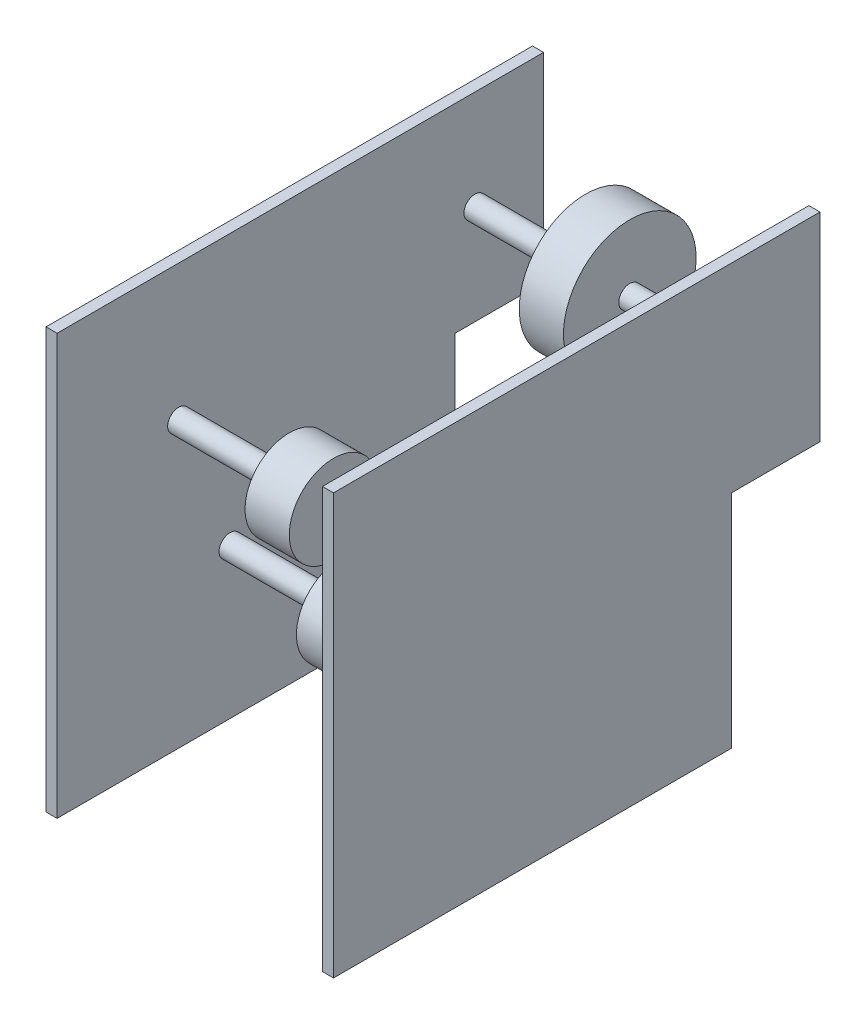
ISO-10303-21;
HEADER;
FILE_DESCRIPTION(('STEP AP214'),'2;1');
FILE_NAME('part.step','',(''),(''),'','','');
FILE_SCHEMA(('AUTOMOTIVE_DESIGN { 1 0 10303 214 1 1 1 1 }'));
ENDSEC;
DATA;
#1=APPLICATION_CONTEXT('core data for automotive mechanical design processes');
#2=APPLICATION_PROTOCOL_DEFINITION('international standard','automotive_design',2000,#1);
#3=PRODUCT_CONTEXT('',#1,'mechanical');
#4=PRODUCT('Part','Part','',(#3));
#5=PRODUCT_RELATED_PRODUCT_CATEGORY('part','',(#4));
#6=PRODUCT_DEFINITION_FORMATION('','',#4);
#7=PRODUCT_DEFINITION_CONTEXT('part definition',#1,'design');
#8=PRODUCT_DEFINITION('design','',#6,#7);
#9=PRODUCT_DEFINITION_SHAPE('','',#8);
#10=(LENGTH_UNIT() NAMED_UNIT(*) SI_UNIT(.MILLI.,.METRE.));
#11=(NAMED_UNIT(*) PLANE_ANGLE_UNIT() SI_UNIT($,.RADIAN.));
#12=(NAMED_UNIT(*) SI_UNIT($,.STERADIAN.) SOLID_ANGLE_UNIT());
#13=UNCERTAINTY_MEASURE_WITH_UNIT(LENGTH_MEASURE(1.E-05),#10,'distance_accuracy_value','');
#14=(GEOMETRIC_REPRESENTATION_CONTEXT(3) GLOBAL_UNCERTAINTY_ASSIGNED_CONTEXT((#13)) GLOBAL_UNIT_ASSIGNED_CONTEXT((#10,
#11,#12)) REPRESENTATION_CONTEXT('',''));
#15=CARTESIAN_POINT('',(0.,0.,0.));
#16=DIRECTION('',(0.,0.,1.));
#17=DIRECTION('',(1.,0.,0.));
#18=AXIS2_PLACEMENT_3D('',#15,#16,#17);
#19=CARTESIAN_POINT('',(76.2,184.15,-240.017328611397));
#20=DIRECTION('',(-1.,0.,0.));
#21=DIRECTION('',(0.,0.,1.));
#22=AXIS2_PLACEMENT_3D('',#19,#20,#21);
#23=CYLINDRICAL_SURFACE('',#22,6.34999999999999);
#24=CARTESIAN_POINT('',(-76.2,184.15,-240.017328611397));
#25=DIRECTION('',(-1.,0.,0.));
#26=DIRECTION('',(0.,0.,1.));
#27=AXIS2_PLACEMENT_3D('',#24,#25,#26);
#28=CIRCLE('',#27,6.34999999999999);
#29=CARTESIAN_POINT('',(-76.2,184.15,-233.667328611397));
#30=VERTEX_POINT('',#29);
#31=EDGE_CURVE('E214',#30,#30,#28,.F.);
#32=ORIENTED_EDGE('',*,*,#31,.T.);
#33=EDGE_LOOP('',(#32));
#34=FACE_BOUND('',#33,.T.);
#35=CARTESIAN_POINT('',(-12.7,184.15,-240.017328611397));
#36=DIRECTION('',(1.,0.,0.));
#37=DIRECTION('',(0.,0.,-1.));
#38=AXIS2_PLACEMENT_3D('',#35,#36,#37);
#39=CIRCLE('',#38,6.34999999999999);
#40=CARTESIAN_POINT('',(-12.7,184.15,-246.367328611397));
#41=VERTEX_POINT('',#40);
#42=EDGE_CURVE('E11',#41,#41,#39,.T.);
#43=ORIENTED_EDGE('',*,*,#42,.F.);
#44=EDGE_LOOP('',(#43));
#45=FACE_BOUND('',#44,.T.);
#46=ADVANCED_FACE('F49',(#34,#45),#23,.T.);
#47=CARTESIAN_POINT('',(76.2,31.75,-161.47216644338));
#48=DIRECTION('',(-1.,0.,0.));
#49=DIRECTION('',(0.,0.,1.));
#50=AXIS2_PLACEMENT_3D('',#47,#48,#49);
#51=CYLINDRICAL_SURFACE('',#50,6.35000000000002);
#52=CARTESIAN_POINT('',(-76.2,31.75,-161.47216644338));
#53=DIRECTION('',(-1.,0.,0.));
#54=DIRECTION('',(0.,0.,1.));
#55=AXIS2_PLACEMENT_3D('',#52,#53,#54);
#56=CIRCLE('',#55,6.35000000000002);
#57=CARTESIAN_POINT('',(-76.2,31.75,-155.12216644338));
#58=VERTEX_POINT('',#57);
#59=EDGE_CURVE('E196',#58,#58,#56,.F.);
#60=ORIENTED_EDGE('',*,*,#59,.T.);
#61=EDGE_LOOP('',(#60));
#62=FACE_BOUND('',#61,.T.);
#63=CARTESIAN_POINT('',(-12.7,31.75,-161.47216644338));
#64=DIRECTION('',(1.,0.,0.));
#65=DIRECTION('',(0.,0.,-1.));
#66=AXIS2_PLACEMENT_3D('',#63,#64,#65);
#67=CIRCLE('',#66,6.35000000000002);
#68=CARTESIAN_POINT('',(-12.7,31.75,-167.82216644338));
#69=VERTEX_POINT('',#68);
#70=EDGE_CURVE('E210',#69,#69,#67,.T.);
#71=ORIENTED_EDGE('',*,*,#70,.F.);
#72=EDGE_LOOP('',(#71));
#73=FACE_BOUND('',#72,.T.);
#74=ADVANCED_FACE('F320',(#62,#73),#51,.T.);
#75=CARTESIAN_POINT('',(76.2,86.1208125309714,-99.3568121038775));
#76=DIRECTION('',(-1.,0.,0.));
#77=DIRECTION('',(0.,0.,1.));
#78=AXIS2_PLACEMENT_3D('',#75,#76,#77);
#79=CYLINDRICAL_SURFACE('',#78,6.34999999999999);
#80=CARTESIAN_POINT('',(-76.2,86.1208125309714,-99.3568121038775));
#81=DIRECTION('',(-1.,0.,0.));
#82=DIRECTION('',(0.,0.,1.));
#83=AXIS2_PLACEMENT_3D('',#80,#81,#82);
#84=CIRCLE('',#83,6.34999999999999);
#85=CARTESIAN_POINT('',(-76.2,86.1208125309714,-93.0068121038775));
#86=VERTEX_POINT('',#85);
#87=EDGE_CURVE('E178',#86,#86,#84,.F.);
#88=ORIENTED_EDGE('',*,*,#87,.T.);
#89=EDGE_LOOP('',(#88));
#90=FACE_BOUND('',#89,.T.);
#91=CARTESIAN_POINT('',(-12.7,86.1208125309714,-99.3568121038775));
#92=DIRECTION('',(1.,0.,0.));
#93=DIRECTION('',(0.,0.,-1.));
#94=AXIS2_PLACEMENT_3D('',#91,#92,#93);
#95=CIRCLE('',#94,6.34999999999999);
#96=CARTESIAN_POINT('',(-12.7,86.1208125309714,-105.706812103877));
#97=VERTEX_POINT('',#96);
#98=EDGE_CURVE('E192',#97,#97,#95,.T.);
#99=ORIENTED_EDGE('',*,*,#98,.F.);
#100=EDGE_LOOP('',(#99));
#101=FACE_BOUND('',#100,.T.);
#102=ADVANCED_FACE('F327',(#90,#101),#79,.T.);
#103=CARTESIAN_POINT('',(76.2,163.217184296875,-69.85));
#104=DIRECTION('',(-1.,0.,0.));
#105=DIRECTION('',(0.,0.,1.));
#106=AXIS2_PLACEMENT_3D('',#103,#104,#105);
#107=CYLINDRICAL_SURFACE('',#106,6.34999999999999);
#108=CARTESIAN_POINT('',(12.7,163.217184296875,-69.85));
#109=DIRECTION('',(1.,0.,0.));
#110=DIRECTION('',(0.,0.,-1.));
#111=AXIS2_PLACEMENT_3D('',#108,#109,#110);
#112=CIRCLE('',#111,6.34999999999999);
#113=CARTESIAN_POINT('',(12.7,163.217184296875,-76.2));
#114=VERTEX_POINT('',#113);
#115=EDGE_CURVE('E179',#114,#114,#112,.T.);
#116=ORIENTED_EDGE('',*,*,#115,.T.);
#117=EDGE_LOOP('',(#116));
#118=FACE_BOUND('',#117,.T.);
#119=CARTESIAN_POINT('',(76.2,163.217184296875,-69.85));
#120=DIRECTION('',(1.,0.,0.));
#121=DIRECTION('',(0.,0.,-1.));
#122=AXIS2_PLACEMENT_3D('',#119,#120,#121);
#123=CIRCLE('',#122,6.34999999999999);
#124=CARTESIAN_POINT('',(76.2,163.217184296875,-76.2));
#125=VERTEX_POINT('',#124);
#126=EDGE_CURVE('E152',#125,#125,#123,.T.);
#127=ORIENTED_EDGE('',*,*,#126,.F.);
#128=EDGE_LOOP('',(#127));
#129=FACE_BOUND('',#128,.T.);
#130=ADVANCED_FACE('F477',(#118,#129),#107,.T.);
#131=CARTESIAN_POINT('',(82.55,0.,0.));
#132=DIRECTION('',(-1.,0.,0.));
#133=DIRECTION('',(0.,0.,1.));
#134=AXIS2_PLACEMENT_3D('',#131,#132,#133);
#135=PLANE('',#134);
#136=DIRECTION('',(0.,-1.,0.));
#137=VECTOR('',#136,1.);
#138=CARTESIAN_POINT('',(82.55,0.,0.));
#139=LINE('',#138,#137);
#140=CARTESIAN_POINT('',(82.55,241.3,0.));
#141=VERTEX_POINT('',#140);
#142=CARTESIAN_POINT('',(82.55,0.,0.));
#143=VERTEX_POINT('',#142);
#144=EDGE_CURVE('E395',#141,#143,#139,.T.);
#145=ORIENTED_EDGE('',*,*,#144,.T.);
#146=DIRECTION('',(0.,0.,-1.));
#147=VECTOR('',#146,1.);
#148=CARTESIAN_POINT('',(82.55,0.,0.));
#149=LINE('',#148,#147);
#150=CARTESIAN_POINT('',(82.55,0.,-228.6));
#151=VERTEX_POINT('',#150);
#152=EDGE_CURVE('E279',#143,#151,#149,.T.);
#153=ORIENTED_EDGE('',*,*,#152,.T.);
#154=DIRECTION('',(0.,1.,0.));
#155=VECTOR('',#154,1.);
#156=CARTESIAN_POINT('',(82.55,127.,-228.6));
#157=LINE('',#156,#155);
#158=CARTESIAN_POINT('',(82.55,127.,-228.6));
#159=VERTEX_POINT('',#158);
#160=EDGE_CURVE('E400',#151,#159,#157,.T.);
#161=ORIENTED_EDGE('',*,*,#160,.T.);
#162=DIRECTION('',(0.,0.,-1.));
#163=VECTOR('',#162,1.);
#164=CARTESIAN_POINT('',(82.55,127.,-228.6));
#165=LINE('',#164,#163);
#166=CARTESIAN_POINT('',(82.55,127.,-279.4));
#167=VERTEX_POINT('',#166);
#168=EDGE_CURVE('E404',#159,#167,#165,.T.);
#169=ORIENTED_EDGE('',*,*,#168,.T.);
#170=DIRECTION('',(0.,1.,0.));
#171=VECTOR('',#170,1.);
#172=CARTESIAN_POINT('',(82.55,241.3,-279.4));
#173=LINE('',#172,#171);
#174=CARTESIAN_POINT('',(82.55,241.3,-279.4));
#175=VERTEX_POINT('',#174);
#176=EDGE_CURVE('E408',#167,#175,#173,.T.);
#177=ORIENTED_EDGE('',*,*,#176,.T.);
#178=DIRECTION('',(0.,0.,1.));
#179=VECTOR('',#178,1.);
#180=CARTESIAN_POINT('',(82.55,241.3,0.));
#181=LINE('',#180,#179);
#182=EDGE_CURVE('E412',#175,#141,#181,.T.);
#183=ORIENTED_EDGE('',*,*,#182,.T.);
#184=EDGE_LOOP('',(#145,#153,#161,#169,#177,#183));
#185=FACE_BOUND('',#184,.T.);
#186=ADVANCED_FACE('F450',(#185),#135,.F.);
#187=CARTESIAN_POINT('',(82.55,241.3,0.));
#188=DIRECTION('',(0.,-1.,0.));
#189=DIRECTION('',(0.,0.,-1.));
#190=AXIS2_PLACEMENT_3D('',#187,#188,#189);
#191=PLANE('',#190);
#192=DIRECTION('',(-1.,0.,0.));
#193=VECTOR('',#192,1.);
#194=CARTESIAN_POINT('',(82.55,241.3,-279.4));
#195=LINE('',#194,#193);
#196=CARTESIAN_POINT('',(76.2,241.3,-279.4));
#197=VERTEX_POINT('',#196);
#198=EDGE_CURVE('E418',#175,#197,#195,.T.);
#199=ORIENTED_EDGE('',*,*,#198,.T.);
#200=DIRECTION('',(0.,0.,-1.));
#201=VECTOR('',#200,1.);
#202=CARTESIAN_POINT('',(76.2,241.3,0.));
#203=LINE('',#202,#201);
#204=CARTESIAN_POINT('',(76.2,241.3,0.));
#205=VERTEX_POINT('',#204);
#206=EDGE_CURVE('E183',#205,#197,#203,.T.);
#207=ORIENTED_EDGE('',*,*,#206,.F.);
#208=DIRECTION('',(-1.,0.,0.));
#209=VECTOR('',#208,1.);
#210=CARTESIAN_POINT('',(82.55,241.3,0.));
#211=LINE('',#210,#209);
#212=EDGE_CURVE('E272',#141,#205,#211,.T.);
#213=ORIENTED_EDGE('',*,*,#212,.F.);
#214=ORIENTED_EDGE('',*,*,#182,.F.);
#215=EDGE_LOOP('',(#199,#207,#213,#214));
#216=FACE_BOUND('',#215,.T.);
#217=ADVANCED_FACE('F454',(#216),#191,.F.);
#218=CARTESIAN_POINT('',(82.55,241.3,-279.4));
#219=DIRECTION('',(0.,0.,1.));
#220=DIRECTION('',(1.,0.,0.));
#221=AXIS2_PLACEMENT_3D('',#218,#219,#220);
#222=PLANE('',#221);
#223=DIRECTION('',(-1.,0.,0.));
#224=VECTOR('',#223,1.);
#225=CARTESIAN_POINT('',(82.55,127.,-279.4));
#226=LINE('',#225,#224);
#227=CARTESIAN_POINT('',(76.2,127.,-279.4));
#228=VERTEX_POINT('',#227);
#229=EDGE_CURVE('E422',#167,#228,#226,.T.);
#230=ORIENTED_EDGE('',*,*,#229,.T.);
#231=DIRECTION('',(0.,1.,0.));
#232=VECTOR('',#231,1.);
#233=CARTESIAN_POINT('',(76.2,0.,-279.4));
#234=LINE('',#233,#232);
#235=EDGE_CURVE('E274',#228,#197,#234,.T.);
#236=ORIENTED_EDGE('',*,*,#235,.T.);
#237=ORIENTED_EDGE('',*,*,#198,.F.);
#238=ORIENTED_EDGE('',*,*,#176,.F.);
#239=EDGE_LOOP('',(#230,#236,#237,#238));
#240=FACE_BOUND('',#239,.T.);
#241=ADVANCED_FACE('F458',(#240),#222,.F.);
#242=CARTESIAN_POINT('',(82.55,127.,-228.6));
#243=DIRECTION('',(0.,1.,0.));
#244=DIRECTION('',(0.,0.,1.));
#245=AXIS2_PLACEMENT_3D('',#242,#243,#244);
#246=PLANE('',#245);
#247=DIRECTION('',(-1.,0.,0.));
#248=VECTOR('',#247,1.);
#249=CARTESIAN_POINT('',(82.55,127.,-228.6));
#250=LINE('',#249,#248);
#251=CARTESIAN_POINT('',(76.2,127.,-228.6));
#252=VERTEX_POINT('',#251);
#253=EDGE_CURVE('E287',#159,#252,#250,.T.);
#254=ORIENTED_EDGE('',*,*,#253,.T.);
#255=DIRECTION('',(0.,0.,-1.));
#256=VECTOR('',#255,1.);
#257=CARTESIAN_POINT('',(76.2,127.,-228.6));
#258=LINE('',#257,#256);
#259=EDGE_CURVE('E388',#252,#228,#258,.T.);
#260=ORIENTED_EDGE('',*,*,#259,.T.);
#261=ORIENTED_EDGE('',*,*,#229,.F.);
#262=ORIENTED_EDGE('',*,*,#168,.F.);
#263=EDGE_LOOP('',(#254,#260,#261,#262));
#264=FACE_BOUND('',#263,.T.);
#265=ADVANCED_FACE('F431',(#264),#246,.F.);
#266=CARTESIAN_POINT('',(82.55,127.,-228.6));
#267=DIRECTION('',(0.,0.,1.));
#268=DIRECTION('',(1.,0.,0.));
#269=AXIS2_PLACEMENT_3D('',#266,#267,#268);
#270=PLANE('',#269);
#271=DIRECTION('',(-1.,0.,0.));
#272=VECTOR('',#271,1.);
#273=CARTESIAN_POINT('',(82.55,0.,-228.6));
#274=LINE('',#273,#272);
#275=CARTESIAN_POINT('',(76.2,0.,-228.6));
#276=VERTEX_POINT('',#275);
#277=EDGE_CURVE('E282',#151,#276,#274,.T.);
#278=ORIENTED_EDGE('',*,*,#277,.T.);
#279=DIRECTION('',(0.,1.,0.));
#280=VECTOR('',#279,1.);
#281=CARTESIAN_POINT('',(76.2,127.,-228.6));
#282=LINE('',#281,#280);
#283=EDGE_CURVE('E256',#276,#252,#282,.T.);
#284=ORIENTED_EDGE('',*,*,#283,.T.);
#285=ORIENTED_EDGE('',*,*,#253,.F.);
#286=ORIENTED_EDGE('',*,*,#160,.F.);
#287=EDGE_LOOP('',(#278,#284,#285,#286));
#288=FACE_BOUND('',#287,.T.);
#289=ADVANCED_FACE('F438',(#288),#270,.F.);
#290=CARTESIAN_POINT('',(82.55,0.,0.));
#291=DIRECTION('',(0.,1.,0.));
#292=DIRECTION('',(0.,0.,1.));
#293=AXIS2_PLACEMENT_3D('',#290,#291,#292);
#294=PLANE('',#293);
#295=DIRECTION('',(-1.,0.,0.));
#296=VECTOR('',#295,1.);
#297=CARTESIAN_POINT('',(82.55,0.,0.));
#298=LINE('',#297,#296);
#299=CARTESIAN_POINT('',(76.2,0.,0.));
#300=VERTEX_POINT('',#299);
#301=EDGE_CURVE('E270',#143,#300,#298,.T.);
#302=ORIENTED_EDGE('',*,*,#301,.T.);
#303=DIRECTION('',(0.,0.,-1.));
#304=VECTOR('',#303,1.);
#305=CARTESIAN_POINT('',(76.2,0.,0.));
#306=LINE('',#305,#304);
#307=EDGE_CURVE('E248',#300,#276,#306,.T.);
#308=ORIENTED_EDGE('',*,*,#307,.T.);
#309=ORIENTED_EDGE('',*,*,#277,.F.);
#310=ORIENTED_EDGE('',*,*,#152,.F.);
#311=EDGE_LOOP('',(#302,#308,#309,#310));
#312=FACE_BOUND('',#311,.T.);
#313=ADVANCED_FACE('F277',(#312),#294,.F.);
#314=CARTESIAN_POINT('',(82.55,0.,0.));
#315=DIRECTION('',(0.,0.,-1.));
#316=DIRECTION('',(-1.,0.,0.));
#317=AXIS2_PLACEMENT_3D('',#314,#315,#316);
#318=PLANE('',#317);
#319=ORIENTED_EDGE('',*,*,#212,.T.);
#320=DIRECTION('',(0.,1.,0.));
#321=VECTOR('',#320,1.);
#322=CARTESIAN_POINT('',(76.2,0.,0.));
#323=LINE('',#322,#321);
#324=EDGE_CURVE('E251',#300,#205,#323,.T.);
#325=ORIENTED_EDGE('',*,*,#324,.F.);
#326=ORIENTED_EDGE('',*,*,#301,.F.);
#327=ORIENTED_EDGE('',*,*,#144,.F.);
#328=EDGE_LOOP('',(#319,#325,#326,#327));
#329=FACE_BOUND('',#328,.T.);
#330=ADVANCED_FACE('F234',(#329),#318,.F.);
#331=CARTESIAN_POINT('',(76.2,0.,0.));
#332=DIRECTION('',(1.,0.,0.));
#333=DIRECTION('',(0.,0.,-1.));
#334=AXIS2_PLACEMENT_3D('',#331,#332,#333);
#335=PLANE('',#334);
#336=CARTESIAN_POINT('',(76.2,184.15,-240.017328611397));
#337=DIRECTION('',(1.,0.,0.));
#338=DIRECTION('',(0.,0.,-1.));
#339=AXIS2_PLACEMENT_3D('',#336,#337,#338);
#340=CIRCLE('',#339,6.34999999999999);
#341=CARTESIAN_POINT('',(76.2,184.15,-246.367328611397));
#342=VERTEX_POINT('',#341);
#343=EDGE_CURVE('E60',#342,#342,#340,.F.);
#344=ORIENTED_EDGE('',*,*,#343,.F.);
#345=EDGE_LOOP('',(#344));
#346=FACE_BOUND('',#345,.T.);
#347=CARTESIAN_POINT('',(76.2,31.75,-161.47216644338));
#348=DIRECTION('',(1.,0.,0.));
#349=DIRECTION('',(0.,0.,-1.));
#350=AXIS2_PLACEMENT_3D('',#347,#348,#349);
#351=CIRCLE('',#350,6.35000000000002);
#352=CARTESIAN_POINT('',(76.2,31.75,-167.82216644338));
#353=VERTEX_POINT('',#352);
#354=EDGE_CURVE('E206',#353,#353,#351,.F.);
#355=ORIENTED_EDGE('',*,*,#354,.F.);
#356=EDGE_LOOP('',(#355));
#357=FACE_BOUND('',#356,.T.);
#358=CARTESIAN_POINT('',(76.2,86.1208125309714,-99.3568121038775));
#359=DIRECTION('',(1.,0.,0.));
#360=DIRECTION('',(0.,0.,-1.));
#361=AXIS2_PLACEMENT_3D('',#358,#359,#360);
#362=CIRCLE('',#361,6.34999999999999);
#363=CARTESIAN_POINT('',(76.2,86.1208125309714,-105.706812103877));
#364=VERTEX_POINT('',#363);
#365=EDGE_CURVE('E188',#364,#364,#362,.F.);
#366=ORIENTED_EDGE('',*,*,#365,.F.);
#367=EDGE_LOOP('',(#366));
#368=FACE_BOUND('',#367,.T.);
#369=ORIENTED_EDGE('',*,*,#126,.T.);
#370=EDGE_LOOP('',(#369));
#371=FACE_BOUND('',#370,.T.);
#372=ORIENTED_EDGE('',*,*,#307,.F.);
#373=ORIENTED_EDGE('',*,*,#324,.T.);
#374=ORIENTED_EDGE('',*,*,#206,.T.);
#375=ORIENTED_EDGE('',*,*,#235,.F.);
#376=ORIENTED_EDGE('',*,*,#259,.F.);
#377=ORIENTED_EDGE('',*,*,#283,.F.);
#378=EDGE_LOOP('',(#372,#373,#374,#375,#376,#377));
#379=FACE_BOUND('',#378,.T.);
#380=ADVANCED_FACE('F230',(#346,#357,#368,#371,#379),#335,.F.);
#381=CARTESIAN_POINT('',(12.7,163.217184296875,-69.85));
#382=DIRECTION('',(-1.,0.,0.));
#383=DIRECTION('',(0.,0.,1.));
#384=AXIS2_PLACEMENT_3D('',#381,#382,#383);
#385=CYLINDRICAL_SURFACE('',#384,25.4);
#386=CARTESIAN_POINT('',(12.7,163.217184296875,-69.85));
#387=DIRECTION('',(1.,0.,0.));
#388=DIRECTION('',(0.,0.,-1.));
#389=AXIS2_PLACEMENT_3D('',#386,#387,#388);
#390=CIRCLE('',#389,25.4);
#391=CARTESIAN_POINT('',(12.7,163.217184296875,-95.25));
#392=VERTEX_POINT('',#391);
#393=EDGE_CURVE('E201',#392,#392,#390,.T.);
#394=ORIENTED_EDGE('',*,*,#393,.F.);
#395=EDGE_LOOP('',(#394));
#396=FACE_BOUND('',#395,.T.);
#397=CARTESIAN_POINT('',(-12.7,163.217184296875,-69.85));
#398=DIRECTION('',(1.,0.,0.));
#399=DIRECTION('',(0.,0.,-1.));
#400=AXIS2_PLACEMENT_3D('',#397,#398,#399);
#401=CIRCLE('',#400,25.4);
#402=CARTESIAN_POINT('',(-12.7,163.217184296875,-95.25));
#403=VERTEX_POINT('',#402);
#404=EDGE_CURVE('E184',#403,#403,#401,.T.);
#405=ORIENTED_EDGE('',*,*,#404,.T.);
#406=EDGE_LOOP('',(#405));
#407=FACE_BOUND('',#406,.T.);
#408=ADVANCED_FACE('F233',(#396,#407),#385,.T.);
#409=CARTESIAN_POINT('',(12.7,163.217184296875,-69.85));
#410=DIRECTION('',(1.,0.,0.));
#411=DIRECTION('',(0.,0.,-1.));
#412=AXIS2_PLACEMENT_3D('',#409,#410,#411);
#413=PLANE('',#412);
#414=ORIENTED_EDGE('',*,*,#115,.F.);
#415=EDGE_LOOP('',(#414));
#416=FACE_BOUND('',#415,.T.);
#417=ORIENTED_EDGE('',*,*,#393,.T.);
#418=EDGE_LOOP('',(#417));
#419=FACE_BOUND('',#418,.T.);
#420=ADVANCED_FACE('F506',(#416,#419),#413,.T.);
#421=CARTESIAN_POINT('',(-12.7,163.217184296875,-69.85));
#422=DIRECTION('',(1.,0.,0.));
#423=DIRECTION('',(0.,0.,-1.));
#424=AXIS2_PLACEMENT_3D('',#421,#422,#423);
#425=PLANE('',#424);
#426=CARTESIAN_POINT('',(-12.7,163.217184296875,-69.85));
#427=DIRECTION('',(1.,0.,0.));
#428=DIRECTION('',(0.,0.,-1.));
#429=AXIS2_PLACEMENT_3D('',#426,#427,#428);
#430=CIRCLE('',#429,6.34999999999999);
#431=CARTESIAN_POINT('',(-12.7,163.217184296875,-76.2));
#432=VERTEX_POINT('',#431);
#433=EDGE_CURVE('E174',#432,#432,#430,.T.);
#434=ORIENTED_EDGE('',*,*,#433,.T.);
#435=EDGE_LOOP('',(#434));
#436=FACE_BOUND('',#435,.T.);
#437=ORIENTED_EDGE('',*,*,#404,.F.);
#438=EDGE_LOOP('',(#437));
#439=FACE_BOUND('',#438,.T.);
#440=ADVANCED_FACE('F483',(#436,#439),#425,.F.);
#441=CARTESIAN_POINT('',(-82.55,0.,0.));
#442=DIRECTION('',(-1.,0.,0.));
#443=DIRECTION('',(0.,0.,1.));
#444=AXIS2_PLACEMENT_3D('',#441,#442,#443);
#445=PLANE('',#444);
#446=DIRECTION('',(0.,-1.,0.));
#447=VECTOR('',#446,1.);
#448=CARTESIAN_POINT('',(-82.55,0.,0.));
#449=LINE('',#448,#447);
#450=CARTESIAN_POINT('',(-82.55,241.3,0.));
#451=VERTEX_POINT('',#450);
#452=CARTESIAN_POINT('',(-82.55,0.,0.));
#453=VERTEX_POINT('',#452);
#454=EDGE_CURVE('E127',#451,#453,#449,.T.);
#455=ORIENTED_EDGE('',*,*,#454,.F.);
#456=DIRECTION('',(0.,0.,1.));
#457=VECTOR('',#456,1.);
#458=CARTESIAN_POINT('',(-82.55,241.3,0.));
#459=LINE('',#458,#457);
#460=CARTESIAN_POINT('',(-82.55,241.3,-279.4));
#461=VERTEX_POINT('',#460);
#462=EDGE_CURVE('E155',#461,#451,#459,.T.);
#463=ORIENTED_EDGE('',*,*,#462,.F.);
#464=DIRECTION('',(0.,1.,0.));
#465=VECTOR('',#464,1.);
#466=CARTESIAN_POINT('',(-82.55,241.3,-279.4));
#467=LINE('',#466,#465);
#468=CARTESIAN_POINT('',(-82.55,127.,-279.4));
#469=VERTEX_POINT('',#468);
#470=EDGE_CURVE('E167',#469,#461,#467,.T.);
#471=ORIENTED_EDGE('',*,*,#470,.F.);
#472=DIRECTION('',(0.,0.,-1.));
#473=VECTOR('',#472,1.);
#474=CARTESIAN_POINT('',(-82.55,127.,-228.6));
#475=LINE('',#474,#473);
#476=CARTESIAN_POINT('',(-82.55,127.,-228.6));
#477=VERTEX_POINT('',#476);
#478=EDGE_CURVE('E163',#477,#469,#475,.T.);
#479=ORIENTED_EDGE('',*,*,#478,.F.);
#480=DIRECTION('',(0.,1.,0.));
#481=VECTOR('',#480,1.);
#482=CARTESIAN_POINT('',(-82.55,127.,-228.6));
#483=LINE('',#482,#481);
#484=CARTESIAN_POINT('',(-82.55,0.,-228.6));
#485=VERTEX_POINT('',#484);
#486=EDGE_CURVE('E129',#485,#477,#483,.T.);
#487=ORIENTED_EDGE('',*,*,#486,.F.);
#488=DIRECTION('',(0.,0.,-1.));
#489=VECTOR('',#488,1.);
#490=CARTESIAN_POINT('',(-82.55,0.,0.));
#491=LINE('',#490,#489);
#492=EDGE_CURVE('E116',#453,#485,#491,.T.);
#493=ORIENTED_EDGE('',*,*,#492,.F.);
#494=EDGE_LOOP('',(#455,#463,#471,#479,#487,#493));
#495=FACE_BOUND('',#494,.T.);
#496=ADVANCED_FACE('F125',(#495),#445,.T.);
#497=CARTESIAN_POINT('',(82.55,127.,-228.6));
#498=DIRECTION('',(0.,0.,1.));
#499=DIRECTION('',(1.,0.,0.));
#500=AXIS2_PLACEMENT_3D('',#497,#498,#499);
#501=PLANE('',#500);
#502=DIRECTION('',(-1.,0.,0.));
#503=VECTOR('',#502,1.);
#504=CARTESIAN_POINT('',(82.55,127.,-228.6));
#505=LINE('',#504,#503);
#506=CARTESIAN_POINT('',(-76.2,127.,-228.6));
#507=VERTEX_POINT('',#506);
#508=EDGE_CURVE('E149',#507,#477,#505,.T.);
#509=ORIENTED_EDGE('',*,*,#508,.F.);
#510=DIRECTION('',(0.,-1.,0.));
#511=VECTOR('',#510,1.);
#512=CARTESIAN_POINT('',(-76.2,127.,-228.6));
#513=LINE('',#512,#511);
#514=CARTESIAN_POINT('',(-76.2,0.,-228.6));
#515=VERTEX_POINT('',#514);
#516=EDGE_CURVE('E68',#507,#515,#513,.T.);
#517=ORIENTED_EDGE('',*,*,#516,.T.);
#518=DIRECTION('',(-1.,0.,0.));
#519=VECTOR('',#518,1.);
#520=CARTESIAN_POINT('',(82.55,0.,-228.6));
#521=LINE('',#520,#519);
#522=EDGE_CURVE('E107',#515,#485,#521,.T.);
#523=ORIENTED_EDGE('',*,*,#522,.T.);
#524=ORIENTED_EDGE('',*,*,#486,.T.);
#525=EDGE_LOOP('',(#509,#517,#523,#524));
#526=FACE_BOUND('',#525,.T.);
#527=ADVANCED_FACE('F300',(#526),#501,.F.);
#528=CARTESIAN_POINT('',(82.55,0.,0.));
#529=DIRECTION('',(0.,1.,0.));
#530=DIRECTION('',(0.,0.,1.));
#531=AXIS2_PLACEMENT_3D('',#528,#529,#530);
#532=PLANE('',#531);
#533=ORIENTED_EDGE('',*,*,#522,.F.);
#534=DIRECTION('',(0.,0.,1.));
#535=VECTOR('',#534,1.);
#536=CARTESIAN_POINT('',(-76.2,0.,0.));
#537=LINE('',#536,#535);
#538=CARTESIAN_POINT('',(-76.2,0.,0.));
#539=VERTEX_POINT('',#538);
#540=EDGE_CURVE('E118',#515,#539,#537,.T.);
#541=ORIENTED_EDGE('',*,*,#540,.T.);
#542=DIRECTION('',(-1.,0.,0.));
#543=VECTOR('',#542,1.);
#544=CARTESIAN_POINT('',(82.55,0.,0.));
#545=LINE('',#544,#543);
#546=EDGE_CURVE('E113',#539,#453,#545,.T.);
#547=ORIENTED_EDGE('',*,*,#546,.T.);
#548=ORIENTED_EDGE('',*,*,#492,.T.);
#549=EDGE_LOOP('',(#533,#541,#547,#548));
#550=FACE_BOUND('',#549,.T.);
#551=ADVANCED_FACE('F115',(#550),#532,.F.);
#552=CARTESIAN_POINT('',(82.55,0.,0.));
#553=DIRECTION('',(0.,0.,-1.));
#554=DIRECTION('',(-1.,0.,0.));
#555=AXIS2_PLACEMENT_3D('',#552,#553,#554);
#556=PLANE('',#555);
#557=ORIENTED_EDGE('',*,*,#546,.F.);
#558=DIRECTION('',(0.,1.,0.));
#559=VECTOR('',#558,1.);
#560=CARTESIAN_POINT('',(-76.2,0.,0.));
#561=LINE('',#560,#559);
#562=CARTESIAN_POINT('',(-76.2,241.3,0.));
#563=VERTEX_POINT('',#562);
#564=EDGE_CURVE('E140',#539,#563,#561,.T.);
#565=ORIENTED_EDGE('',*,*,#564,.T.);
#566=DIRECTION('',(-1.,0.,0.));
#567=VECTOR('',#566,1.);
#568=CARTESIAN_POINT('',(82.55,241.3,0.));
#569=LINE('',#568,#567);
#570=EDGE_CURVE('E133',#563,#451,#569,.T.);
#571=ORIENTED_EDGE('',*,*,#570,.T.);
#572=ORIENTED_EDGE('',*,*,#454,.T.);
#573=EDGE_LOOP('',(#557,#565,#571,#572));
#574=FACE_BOUND('',#573,.T.);
#575=ADVANCED_FACE('F51',(#574),#556,.F.);
#576=CARTESIAN_POINT('',(82.55,241.3,0.));
#577=DIRECTION('',(0.,-1.,0.));
#578=DIRECTION('',(0.,0.,-1.));
#579=AXIS2_PLACEMENT_3D('',#576,#577,#578);
#580=PLANE('',#579);
#581=ORIENTED_EDGE('',*,*,#570,.F.);
#582=DIRECTION('',(0.,0.,1.));
#583=VECTOR('',#582,1.);
#584=CARTESIAN_POINT('',(-76.2,241.3,0.));
#585=LINE('',#584,#583);
#586=CARTESIAN_POINT('',(-76.2,241.3,-279.4));
#587=VERTEX_POINT('',#586);
#588=EDGE_CURVE('E83',#587,#563,#585,.T.);
#589=ORIENTED_EDGE('',*,*,#588,.F.);
#590=DIRECTION('',(-1.,0.,0.));
#591=VECTOR('',#590,1.);
#592=CARTESIAN_POINT('',(82.55,241.3,-279.4));
#593=LINE('',#592,#591);
#594=EDGE_CURVE('E168',#587,#461,#593,.T.);
#595=ORIENTED_EDGE('',*,*,#594,.T.);
#596=ORIENTED_EDGE('',*,*,#462,.T.);
#597=EDGE_LOOP('',(#581,#589,#595,#596));
#598=FACE_BOUND('',#597,.T.);
#599=ADVANCED_FACE('F310',(#598),#580,.F.);
#600=CARTESIAN_POINT('',(82.55,241.3,-279.4));
#601=DIRECTION('',(0.,0.,1.));
#602=DIRECTION('',(1.,0.,0.));
#603=AXIS2_PLACEMENT_3D('',#600,#601,#602);
#604=PLANE('',#603);
#605=ORIENTED_EDGE('',*,*,#594,.F.);
#606=DIRECTION('',(0.,1.,0.));
#607=VECTOR('',#606,1.);
#608=CARTESIAN_POINT('',(-76.2,0.,-279.4));
#609=LINE('',#608,#607);
#610=CARTESIAN_POINT('',(-76.2,127.,-279.4));
#611=VERTEX_POINT('',#610);
#612=EDGE_CURVE('E87',#611,#587,#609,.T.);
#613=ORIENTED_EDGE('',*,*,#612,.F.);
#614=DIRECTION('',(-1.,0.,0.));
#615=VECTOR('',#614,1.);
#616=CARTESIAN_POINT('',(82.55,127.,-279.4));
#617=LINE('',#616,#615);
#618=EDGE_CURVE('E164',#611,#469,#617,.T.);
#619=ORIENTED_EDGE('',*,*,#618,.T.);
#620=ORIENTED_EDGE('',*,*,#470,.T.);
#621=EDGE_LOOP('',(#605,#613,#619,#620));
#622=FACE_BOUND('',#621,.T.);
#623=ADVANCED_FACE('F308',(#622),#604,.F.);
#624=CARTESIAN_POINT('',(82.55,127.,-228.6));
#625=DIRECTION('',(0.,1.,0.));
#626=DIRECTION('',(0.,0.,1.));
#627=AXIS2_PLACEMENT_3D('',#624,#625,#626);
#628=PLANE('',#627);
#629=ORIENTED_EDGE('',*,*,#618,.F.);
#630=DIRECTION('',(0.,0.,1.));
#631=VECTOR('',#630,1.);
#632=CARTESIAN_POINT('',(-76.2,127.,-228.6));
#633=LINE('',#632,#631);
#634=EDGE_CURVE('E146',#611,#507,#633,.T.);
#635=ORIENTED_EDGE('',*,*,#634,.T.);
#636=ORIENTED_EDGE('',*,*,#508,.T.);
#637=ORIENTED_EDGE('',*,*,#478,.T.);
#638=EDGE_LOOP('',(#629,#635,#636,#637));
#639=FACE_BOUND('',#638,.T.);
#640=ADVANCED_FACE('F304',(#639),#628,.F.);
#641=CARTESIAN_POINT('',(-76.2,0.,0.));
#642=DIRECTION('',(-1.,0.,0.));
#643=DIRECTION('',(0.,0.,1.));
#644=AXIS2_PLACEMENT_3D('',#641,#642,#643);
#645=PLANE('',#644);
#646=ORIENTED_EDGE('',*,*,#31,.F.);
#647=EDGE_LOOP('',(#646));
#648=FACE_BOUND('',#647,.T.);
#649=ORIENTED_EDGE('',*,*,#59,.F.);
#650=EDGE_LOOP('',(#649));
#651=FACE_BOUND('',#650,.T.);
#652=ORIENTED_EDGE('',*,*,#87,.F.);
#653=EDGE_LOOP('',(#652));
#654=FACE_BOUND('',#653,.T.);
#655=CARTESIAN_POINT('',(-76.2,163.217184296875,-69.85));
#656=DIRECTION('',(-1.,0.,0.));
#657=DIRECTION('',(0.,0.,1.));
#658=AXIS2_PLACEMENT_3D('',#655,#656,#657);
#659=CIRCLE('',#658,6.34999999999999);
#660=CARTESIAN_POINT('',(-76.2,163.217184296875,-63.5));
#661=VERTEX_POINT('',#660);
#662=EDGE_CURVE('E157',#661,#661,#659,.F.);
#663=ORIENTED_EDGE('',*,*,#662,.F.);
#664=EDGE_LOOP('',(#663));
#665=FACE_BOUND('',#664,.T.);
#666=ORIENTED_EDGE('',*,*,#634,.F.);
#667=ORIENTED_EDGE('',*,*,#612,.T.);
#668=ORIENTED_EDGE('',*,*,#588,.T.);
#669=ORIENTED_EDGE('',*,*,#564,.F.);
#670=ORIENTED_EDGE('',*,*,#540,.F.);
#671=ORIENTED_EDGE('',*,*,#516,.F.);
#672=EDGE_LOOP('',(#666,#667,#668,#669,#670,#671));
#673=FACE_BOUND('',#672,.T.);
#674=ADVANCED_FACE('F305',(#648,#651,#654,#665,#673),#645,.F.);
#675=ORIENTED_EDGE('',*,*,#662,.T.);
#676=EDGE_LOOP('',(#675));
#677=FACE_BOUND('',#676,.T.);
#678=ORIENTED_EDGE('',*,*,#433,.F.);
#679=EDGE_LOOP('',(#678));
#680=FACE_BOUND('',#679,.T.);
#681=ADVANCED_FACE('F481',(#677,#680),#107,.T.);
#682=CARTESIAN_POINT('',(12.7,86.1208125309714,-99.3568121038775));
#683=DIRECTION('',(1.,0.,0.));
#684=DIRECTION('',(0.,0.,-1.));
#685=AXIS2_PLACEMENT_3D('',#682,#683,#684);
#686=CIRCLE('',#685,6.34999999999999);
#687=CARTESIAN_POINT('',(12.7,86.1208125309714,-105.706812103877));
#688=VERTEX_POINT('',#687);
#689=EDGE_CURVE('E197',#688,#688,#686,.T.);
#690=ORIENTED_EDGE('',*,*,#689,.T.);
#691=EDGE_LOOP('',(#690));
#692=FACE_BOUND('',#691,.T.);
#693=ORIENTED_EDGE('',*,*,#365,.T.);
#694=EDGE_LOOP('',(#693));
#695=FACE_BOUND('',#694,.T.);
#696=ADVANCED_FACE('F491',(#692,#695),#79,.T.);
#697=CARTESIAN_POINT('',(12.7,86.1208125309714,-99.3568121038775));
#698=DIRECTION('',(-1.,0.,0.));
#699=DIRECTION('',(0.,0.,1.));
#700=AXIS2_PLACEMENT_3D('',#697,#698,#699);
#701=CYLINDRICAL_SURFACE('',#700,25.4);
#702=CARTESIAN_POINT('',(12.7,86.1208125309714,-99.3568121038775));
#703=DIRECTION('',(1.,0.,0.));
#704=DIRECTION('',(0.,0.,-1.));
#705=AXIS2_PLACEMENT_3D('',#702,#703,#704);
#706=CIRCLE('',#705,25.4);
#707=CARTESIAN_POINT('',(12.7,86.1208125309714,-124.756812103877));
#708=VERTEX_POINT('',#707);
#709=EDGE_CURVE('E219',#708,#708,#706,.T.);
#710=ORIENTED_EDGE('',*,*,#709,.F.);
#711=EDGE_LOOP('',(#710));
#712=FACE_BOUND('',#711,.T.);
#713=CARTESIAN_POINT('',(-12.7,86.1208125309714,-99.3568121038775));
#714=DIRECTION('',(1.,0.,0.));
#715=DIRECTION('',(0.,0.,-1.));
#716=AXIS2_PLACEMENT_3D('',#713,#714,#715);
#717=CIRCLE('',#716,25.4);
#718=CARTESIAN_POINT('',(-12.7,86.1208125309714,-124.756812103877));
#719=VERTEX_POINT('',#718);
#720=EDGE_CURVE('E202',#719,#719,#717,.T.);
#721=ORIENTED_EDGE('',*,*,#720,.T.);
#722=EDGE_LOOP('',(#721));
#723=FACE_BOUND('',#722,.T.);
#724=ADVANCED_FACE('F629',(#712,#723),#701,.T.);
#725=CARTESIAN_POINT('',(12.7,86.1208125309714,-99.3568121038775));
#726=DIRECTION('',(1.,0.,0.));
#727=DIRECTION('',(0.,0.,-1.));
#728=AXIS2_PLACEMENT_3D('',#725,#726,#727);
#729=PLANE('',#728);
#730=ORIENTED_EDGE('',*,*,#689,.F.);
#731=EDGE_LOOP('',(#730));
#732=FACE_BOUND('',#731,.T.);
#733=ORIENTED_EDGE('',*,*,#709,.T.);
#734=EDGE_LOOP('',(#733));
#735=FACE_BOUND('',#734,.T.);
#736=ADVANCED_FACE('F633',(#732,#735),#729,.T.);
#737=CARTESIAN_POINT('',(-12.7,86.1208125309714,-99.3568121038775));
#738=DIRECTION('',(1.,0.,0.));
#739=DIRECTION('',(0.,0.,-1.));
#740=AXIS2_PLACEMENT_3D('',#737,#738,#739);
#741=PLANE('',#740);
#742=ORIENTED_EDGE('',*,*,#98,.T.);
#743=EDGE_LOOP('',(#742));
#744=FACE_BOUND('',#743,.T.);
#745=ORIENTED_EDGE('',*,*,#720,.F.);
#746=EDGE_LOOP('',(#745));
#747=FACE_BOUND('',#746,.T.);
#748=ADVANCED_FACE('F644',(#744,#747),#741,.F.);
#749=CARTESIAN_POINT('',(12.7,31.75,-161.47216644338));
#750=DIRECTION('',(1.,0.,0.));
#751=DIRECTION('',(0.,0.,-1.));
#752=AXIS2_PLACEMENT_3D('',#749,#750,#751);
#753=CIRCLE('',#752,6.35000000000002);
#754=CARTESIAN_POINT('',(12.7,31.75,-167.82216644338));
#755=VERTEX_POINT('',#754);
#756=EDGE_CURVE('E215',#755,#755,#753,.T.);
#757=ORIENTED_EDGE('',*,*,#756,.T.);
#758=EDGE_LOOP('',(#757));
#759=FACE_BOUND('',#758,.T.);
#760=ORIENTED_EDGE('',*,*,#354,.T.);
#761=EDGE_LOOP('',(#760));
#762=FACE_BOUND('',#761,.T.);
#763=ADVANCED_FACE('F330',(#759,#762),#51,.T.);
#764=CARTESIAN_POINT('',(12.7,31.75,-161.47216644338));
#765=DIRECTION('',(-1.,0.,0.));
#766=DIRECTION('',(0.,0.,1.));
#767=AXIS2_PLACEMENT_3D('',#764,#765,#766);
#768=CYLINDRICAL_SURFACE('',#767,25.4);
#769=CARTESIAN_POINT('',(12.7,31.75,-161.47216644338));
#770=DIRECTION('',(1.,0.,0.));
#771=DIRECTION('',(0.,0.,-1.));
#772=AXIS2_PLACEMENT_3D('',#769,#770,#771);
#773=CIRCLE('',#772,25.4);
#774=CARTESIAN_POINT('',(12.7,31.75,-186.87216644338));
#775=VERTEX_POINT('',#774);
#776=EDGE_CURVE('E220',#775,#775,#773,.T.);
#777=ORIENTED_EDGE('',*,*,#776,.F.);
#778=EDGE_LOOP('',(#777));
#779=FACE_BOUND('',#778,.T.);
#780=CARTESIAN_POINT('',(-12.7,31.75,-161.47216644338));
#781=DIRECTION('',(1.,0.,0.));
#782=DIRECTION('',(0.,0.,-1.));
#783=AXIS2_PLACEMENT_3D('',#780,#781,#782);
#784=CIRCLE('',#783,25.4);
#785=CARTESIAN_POINT('',(-12.7,31.75,-186.87216644338));
#786=VERTEX_POINT('',#785);
#787=EDGE_CURVE('E354',#786,#786,#784,.T.);
#788=ORIENTED_EDGE('',*,*,#787,.T.);
#789=EDGE_LOOP('',(#788));
#790=FACE_BOUND('',#789,.T.);
#791=ADVANCED_FACE('F660',(#779,#790),#768,.T.);
#792=CARTESIAN_POINT('',(12.7,31.75,-161.47216644338));
#793=DIRECTION('',(1.,0.,0.));
#794=DIRECTION('',(0.,0.,-1.));
#795=AXIS2_PLACEMENT_3D('',#792,#793,#794);
#796=PLANE('',#795);
#797=ORIENTED_EDGE('',*,*,#756,.F.);
#798=EDGE_LOOP('',(#797));
#799=FACE_BOUND('',#798,.T.);
#800=ORIENTED_EDGE('',*,*,#776,.T.);
#801=EDGE_LOOP('',(#800));
#802=FACE_BOUND('',#801,.T.);
#803=ADVANCED_FACE('F347',(#799,#802),#796,.T.);
#804=CARTESIAN_POINT('',(-12.7,31.75,-161.47216644338));
#805=DIRECTION('',(1.,0.,0.));
#806=DIRECTION('',(0.,0.,-1.));
#807=AXIS2_PLACEMENT_3D('',#804,#805,#806);
#808=PLANE('',#807);
#809=ORIENTED_EDGE('',*,*,#70,.T.);
#810=EDGE_LOOP('',(#809));
#811=FACE_BOUND('',#810,.T.);
#812=ORIENTED_EDGE('',*,*,#787,.F.);
#813=EDGE_LOOP('',(#812));
#814=FACE_BOUND('',#813,.T.);
#815=ADVANCED_FACE('F336',(#811,#814),#808,.F.);
#816=CARTESIAN_POINT('',(12.7,184.15,-240.017328611397));
#817=DIRECTION('',(1.,0.,0.));
#818=DIRECTION('',(0.,0.,-1.));
#819=AXIS2_PLACEMENT_3D('',#816,#817,#818);
#820=CIRCLE('',#819,6.34999999999999);
#821=CARTESIAN_POINT('',(12.7,184.15,-246.367328611397));
#822=VERTEX_POINT('',#821);
#823=EDGE_CURVE('E53',#822,#822,#820,.T.);
#824=ORIENTED_EDGE('',*,*,#823,.T.);
#825=EDGE_LOOP('',(#824));
#826=FACE_BOUND('',#825,.T.);
#827=ORIENTED_EDGE('',*,*,#343,.T.);
#828=EDGE_LOOP('',(#827));
#829=FACE_BOUND('',#828,.T.);
#830=ADVANCED_FACE('F228',(#826,#829),#23,.T.);
#831=CARTESIAN_POINT('',(12.7,184.15,-240.017328611397));
#832=DIRECTION('',(-1.,0.,0.));
#833=DIRECTION('',(0.,0.,1.));
#834=AXIS2_PLACEMENT_3D('',#831,#832,#833);
#835=CYLINDRICAL_SURFACE('',#834,38.1000000000001);
#836=CARTESIAN_POINT('',(12.7,184.15,-240.017328611397));
#837=DIRECTION('',(1.,0.,0.));
#838=DIRECTION('',(0.,0.,-1.));
#839=AXIS2_PLACEMENT_3D('',#836,#837,#838);
#840=CIRCLE('',#839,38.1000000000001);
#841=CARTESIAN_POINT('',(12.7,184.15,-278.117328611397));
#842=VERTEX_POINT('',#841);
#843=EDGE_CURVE('E361',#842,#842,#840,.T.);
#844=ORIENTED_EDGE('',*,*,#843,.F.);
#845=EDGE_LOOP('',(#844));
#846=FACE_BOUND('',#845,.T.);
#847=CARTESIAN_POINT('',(-12.7,184.15,-240.017328611397));
#848=DIRECTION('',(1.,0.,0.));
#849=DIRECTION('',(0.,0.,-1.));
#850=AXIS2_PLACEMENT_3D('',#847,#848,#849);
#851=CIRCLE('',#850,38.1000000000001);
#852=CARTESIAN_POINT('',(-12.7,184.15,-278.117328611397));
#853=VERTEX_POINT('',#852);
#854=EDGE_CURVE('E355',#853,#853,#851,.T.);
#855=ORIENTED_EDGE('',*,*,#854,.T.);
#856=EDGE_LOOP('',(#855));
#857=FACE_BOUND('',#856,.T.);
#858=ADVANCED_FACE('F335',(#846,#857),#835,.T.);
#859=CARTESIAN_POINT('',(12.7,184.15,-240.017328611397));
#860=DIRECTION('',(1.,0.,0.));
#861=DIRECTION('',(0.,0.,-1.));
#862=AXIS2_PLACEMENT_3D('',#859,#860,#861);
#863=PLANE('',#862);
#864=ORIENTED_EDGE('',*,*,#823,.F.);
#865=EDGE_LOOP('',(#864));
#866=FACE_BOUND('',#865,.T.);
#867=ORIENTED_EDGE('',*,*,#843,.T.);
#868=EDGE_LOOP('',(#867));
#869=FACE_BOUND('',#868,.T.);
#870=ADVANCED_FACE('F343',(#866,#869),#863,.T.);
#871=CARTESIAN_POINT('',(-12.7,184.15,-240.017328611397));
#872=DIRECTION('',(1.,0.,0.));
#873=DIRECTION('',(0.,0.,-1.));
#874=AXIS2_PLACEMENT_3D('',#871,#872,#873);
#875=PLANE('',#874);
#876=ORIENTED_EDGE('',*,*,#42,.T.);
#877=EDGE_LOOP('',(#876));
#878=FACE_BOUND('',#877,.T.);
#879=ORIENTED_EDGE('',*,*,#854,.F.);
#880=EDGE_LOOP('',(#879));
#881=FACE_BOUND('',#880,.T.);
#882=ADVANCED_FACE('F691',(#878,#881),#875,.F.);
#883=CLOSED_SHELL('',(#46,#74,#102,#130,#186,#217,#241,#265,#289,#313,#330,#380,#408,#420,#440,
#496,#527,#551,#575,#599,#623,#640,#674,#681,#696,#724,#736,#748,#763,#791,#803,#815,#830,#858,
#870,#882));
#884=MANIFOLD_SOLID_BREP('B2',#883);
#885=ADVANCED_BREP_SHAPE_REPRESENTATION('',(#18,#884),#14);
#886=SHAPE_DEFINITION_REPRESENTATION(#9,#885);
ENDSEC;
END-ISO-10303-21;
